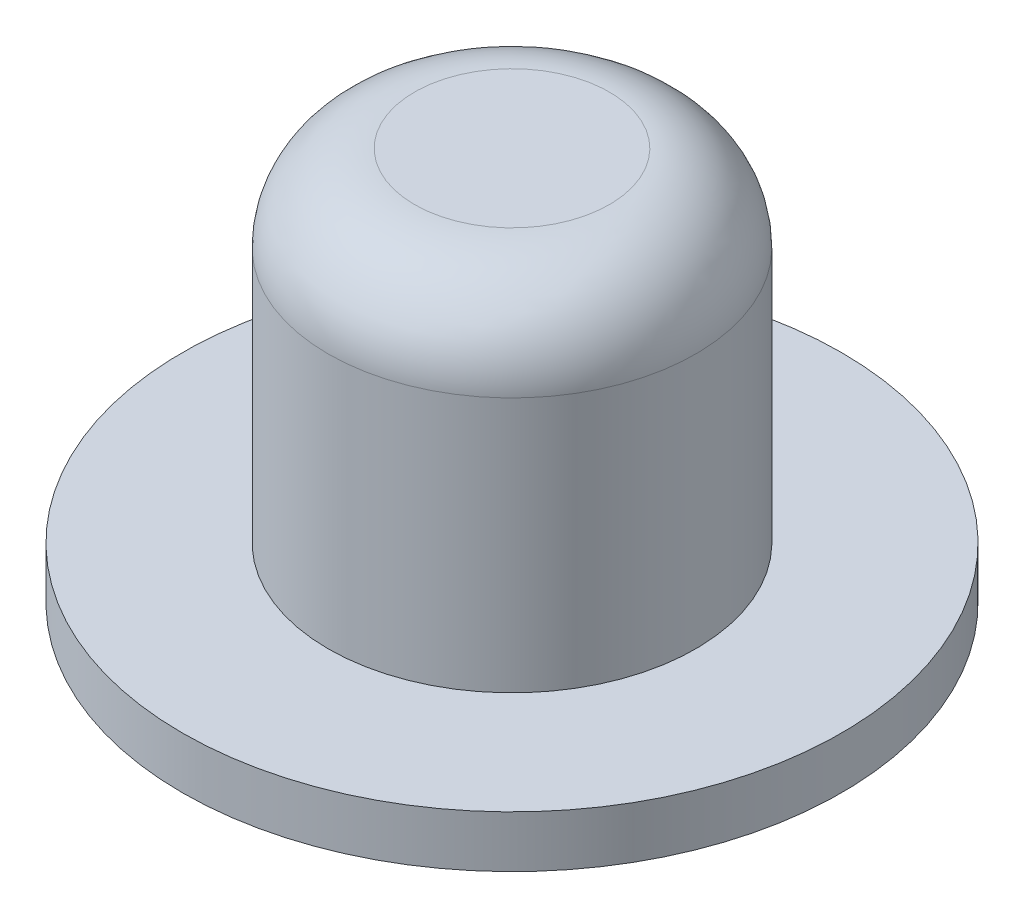
ISO-10303-21;
HEADER;
FILE_DESCRIPTION(('STEP AP214'),'2;1');
FILE_NAME('part.step','',(''),(''),'','','');
FILE_SCHEMA(('AUTOMOTIVE_DESIGN { 1 0 10303 214 1 1 1 1 }'));
ENDSEC;
DATA;
#1=APPLICATION_CONTEXT('core data for automotive mechanical design processes');
#2=APPLICATION_PROTOCOL_DEFINITION('international standard','automotive_design',2000,#1);
#3=PRODUCT_CONTEXT('',#1,'mechanical');
#4=PRODUCT('Part','Part','',(#3));
#5=PRODUCT_RELATED_PRODUCT_CATEGORY('part','',(#4));
#6=PRODUCT_DEFINITION_FORMATION('','',#4);
#7=PRODUCT_DEFINITION_CONTEXT('part definition',#1,'design');
#8=PRODUCT_DEFINITION('design','',#6,#7);
#9=PRODUCT_DEFINITION_SHAPE('','',#8);
#10=(LENGTH_UNIT() NAMED_UNIT(*) SI_UNIT(.MILLI.,.METRE.));
#11=(NAMED_UNIT(*) PLANE_ANGLE_UNIT() SI_UNIT($,.RADIAN.));
#12=(NAMED_UNIT(*) SI_UNIT($,.STERADIAN.) SOLID_ANGLE_UNIT());
#13=UNCERTAINTY_MEASURE_WITH_UNIT(LENGTH_MEASURE(1.E-05),#10,'distance_accuracy_value','');
#14=(GEOMETRIC_REPRESENTATION_CONTEXT(3) GLOBAL_UNCERTAINTY_ASSIGNED_CONTEXT((#13)) GLOBAL_UNIT_ASSIGNED_CONTEXT((#10,
#11,#12)) REPRESENTATION_CONTEXT('',''));
#15=CARTESIAN_POINT('',(0.,0.,0.));
#16=DIRECTION('',(0.,0.,1.));
#17=DIRECTION('',(1.,0.,0.));
#18=AXIS2_PLACEMENT_3D('',#15,#16,#17);
#19=CARTESIAN_POINT('',(0.,3.,0.));
#20=DIRECTION('',(0.,1.,0.));
#21=DIRECTION('',(0.,0.,1.));
#22=AXIS2_PLACEMENT_3D('',#19,#20,#21);
#23=PLANE('',#22);
#24=CARTESIAN_POINT('',(0.,3.,0.));
#25=DIRECTION('',(0.,1.,0.));
#26=DIRECTION('',(0.,0.,1.));
#27=AXIS2_PLACEMENT_3D('',#24,#25,#26);
#28=CIRCLE('',#27,19.1);
#29=CARTESIAN_POINT('',(0.,3.,19.1));
#30=VERTEX_POINT('',#29);
#31=EDGE_CURVE('E46',#30,#30,#28,.T.);
#32=ORIENTED_EDGE('',*,*,#31,.T.);
#33=EDGE_LOOP('',(#32));
#34=FACE_BOUND('',#33,.T.);
#35=CARTESIAN_POINT('',(0.,3.,0.));
#36=DIRECTION('',(0.,1.,0.));
#37=DIRECTION('',(0.,0.,1.));
#38=AXIS2_PLACEMENT_3D('',#35,#36,#37);
#39=CIRCLE('',#38,10.65);
#40=CARTESIAN_POINT('',(0.,3.,10.65));
#41=VERTEX_POINT('',#40);
#42=EDGE_CURVE('E54',#41,#41,#39,.T.);
#43=ORIENTED_EDGE('',*,*,#42,.F.);
#44=EDGE_LOOP('',(#43));
#45=FACE_BOUND('',#44,.T.);
#46=ADVANCED_FACE('F35',(#34,#45),#23,.T.);
#47=CARTESIAN_POINT('',(0.,0.,0.));
#48=DIRECTION('',(0.,1.,0.));
#49=DIRECTION('',(0.,0.,1.));
#50=AXIS2_PLACEMENT_3D('',#47,#48,#49);
#51=PLANE('',#50);
#52=CARTESIAN_POINT('',(0.,0.,0.));
#53=DIRECTION('',(0.,1.,0.));
#54=DIRECTION('',(0.,0.,1.));
#55=AXIS2_PLACEMENT_3D('',#52,#53,#54);
#56=CIRCLE('',#55,19.1);
#57=CARTESIAN_POINT('',(0.,0.,19.1));
#58=VERTEX_POINT('',#57);
#59=EDGE_CURVE('E50',#58,#58,#56,.T.);
#60=ORIENTED_EDGE('',*,*,#59,.F.);
#61=EDGE_LOOP('',(#60));
#62=FACE_BOUND('',#61,.T.);
#63=ADVANCED_FACE('F62',(#62),#51,.F.);
#64=CARTESIAN_POINT('',(0.,3.,0.));
#65=DIRECTION('',(0.,-1.,0.));
#66=DIRECTION('',(0.,0.,-1.));
#67=AXIS2_PLACEMENT_3D('',#64,#65,#66);
#68=CYLINDRICAL_SURFACE('',#67,19.1);
#69=ORIENTED_EDGE('',*,*,#31,.F.);
#70=EDGE_LOOP('',(#69));
#71=FACE_BOUND('',#70,.T.);
#72=ORIENTED_EDGE('',*,*,#59,.T.);
#73=EDGE_LOOP('',(#72));
#74=FACE_BOUND('',#73,.T.);
#75=ADVANCED_FACE('F68',(#71,#74),#68,.T.);
#76=CARTESIAN_POINT('',(0.,22.8,0.));
#77=DIRECTION('',(0.,-1.,0.));
#78=DIRECTION('',(0.,0.,-1.));
#79=AXIS2_PLACEMENT_3D('',#76,#77,#78);
#80=CYLINDRICAL_SURFACE('',#79,10.65);
#81=CARTESIAN_POINT('',(0.,17.8,0.));
#82=DIRECTION('',(0.,1.,0.));
#83=DIRECTION('',(0.,0.,1.));
#84=AXIS2_PLACEMENT_3D('',#81,#82,#83);
#85=CIRCLE('',#84,10.65);
#86=CARTESIAN_POINT('',(0.,17.8,10.65));
#87=VERTEX_POINT('',#86);
#88=EDGE_CURVE('E10',#87,#87,#85,.F.);
#89=ORIENTED_EDGE('',*,*,#88,.T.);
#90=EDGE_LOOP('',(#89));
#91=FACE_BOUND('',#90,.T.);
#92=ORIENTED_EDGE('',*,*,#42,.T.);
#93=EDGE_LOOP('',(#92));
#94=FACE_BOUND('',#93,.T.);
#95=ADVANCED_FACE('F59',(#91,#94),#80,.T.);
#96=CARTESIAN_POINT('',(0.,22.8,0.));
#97=DIRECTION('',(0.,1.,0.));
#98=DIRECTION('',(0.,0.,1.));
#99=AXIS2_PLACEMENT_3D('',#96,#97,#98);
#100=PLANE('',#99);
#101=CARTESIAN_POINT('',(0.,22.8,0.));
#102=DIRECTION('',(0.,1.,0.));
#103=DIRECTION('',(0.,0.,1.));
#104=AXIS2_PLACEMENT_3D('',#101,#102,#103);
#105=CIRCLE('',#104,5.65);
#106=CARTESIAN_POINT('',(0.,22.8,5.65));
#107=VERTEX_POINT('',#106);
#108=EDGE_CURVE('E42',#107,#107,#105,.T.);
#109=ORIENTED_EDGE('',*,*,#108,.T.);
#110=EDGE_LOOP('',(#109));
#111=FACE_BOUND('',#110,.T.);
#112=ADVANCED_FACE('F78',(#111),#100,.T.);
#113=CARTESIAN_POINT('',(0.,17.8,0.));
#114=DIRECTION('',(0.,1.,0.));
#115=DIRECTION('',(0.,0.,1.));
#116=AXIS2_PLACEMENT_3D('',#113,#114,#115);
#117=TOROIDAL_SURFACE('',#116,5.65,5.);
#118=ORIENTED_EDGE('',*,*,#88,.F.);
#119=EDGE_LOOP('',(#118));
#120=FACE_BOUND('',#119,.T.);
#121=ORIENTED_EDGE('',*,*,#108,.F.);
#122=EDGE_LOOP('',(#121));
#123=FACE_BOUND('',#122,.T.);
#124=ADVANCED_FACE('F37',(#120,#123),#117,.T.);
#125=CLOSED_SHELL('',(#46,#63,#75,#95,#112,#124));
#126=MANIFOLD_SOLID_BREP('B2',#125);
#127=ADVANCED_BREP_SHAPE_REPRESENTATION('',(#18,#126),#14);
#128=SHAPE_DEFINITION_REPRESENTATION(#9,#127);
ENDSEC;
END-ISO-10303-21;
